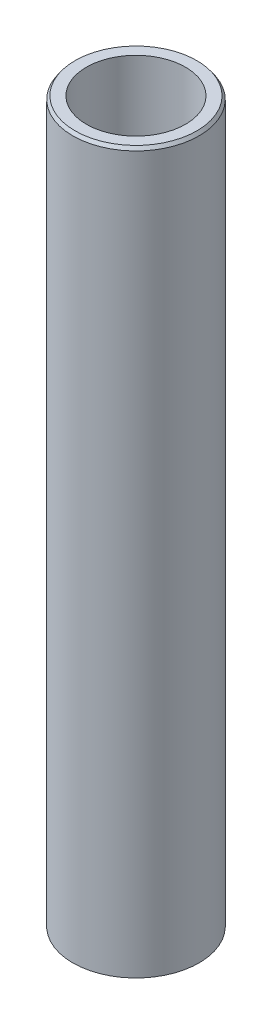
ISO-10303-21;
HEADER;
FILE_DESCRIPTION(('STEP AP214'),'2;1');
FILE_NAME('part.step','',(''),(''),'','','');
FILE_SCHEMA(('AUTOMOTIVE_DESIGN { 1 0 10303 214 1 1 1 1 }'));
ENDSEC;
DATA;
#1=APPLICATION_CONTEXT('core data for automotive mechanical design processes');
#2=APPLICATION_PROTOCOL_DEFINITION('international standard','automotive_design',2000,#1);
#3=PRODUCT_CONTEXT('',#1,'mechanical');
#4=PRODUCT('Part','Part','',(#3));
#5=PRODUCT_RELATED_PRODUCT_CATEGORY('part','',(#4));
#6=PRODUCT_DEFINITION_FORMATION('','',#4);
#7=PRODUCT_DEFINITION_CONTEXT('part definition',#1,'design');
#8=PRODUCT_DEFINITION('design','',#6,#7);
#9=PRODUCT_DEFINITION_SHAPE('','',#8);
#10=(LENGTH_UNIT() NAMED_UNIT(*) SI_UNIT(.MILLI.,.METRE.));
#11=(NAMED_UNIT(*) PLANE_ANGLE_UNIT() SI_UNIT($,.RADIAN.));
#12=(NAMED_UNIT(*) SI_UNIT($,.STERADIAN.) SOLID_ANGLE_UNIT());
#13=UNCERTAINTY_MEASURE_WITH_UNIT(LENGTH_MEASURE(1.E-05),#10,'distance_accuracy_value','');
#14=(GEOMETRIC_REPRESENTATION_CONTEXT(3) GLOBAL_UNCERTAINTY_ASSIGNED_CONTEXT((#13)) GLOBAL_UNIT_ASSIGNED_CONTEXT((#10,
#11,#12)) REPRESENTATION_CONTEXT('',''));
#15=CARTESIAN_POINT('',(0.,0.,0.));
#16=DIRECTION('',(0.,0.,1.));
#17=DIRECTION('',(1.,0.,0.));
#18=AXIS2_PLACEMENT_3D('',#15,#16,#17);
#19=CARTESIAN_POINT('',(0.,600.,0.));
#20=DIRECTION('',(0.,-1.,0.));
#21=DIRECTION('',(0.,0.,-1.));
#22=AXIS2_PLACEMENT_3D('',#19,#20,#21);
#23=CYLINDRICAL_SURFACE('',#22,52.5);
#24=CARTESIAN_POINT('',(0.,597.334114293965,0.));
#25=DIRECTION('',(0.,1.,0.));
#26=DIRECTION('',(0.,0.,1.));
#27=AXIS2_PLACEMENT_3D('',#24,#25,#26);
#28=CIRCLE('',#27,52.5);
#29=CARTESIAN_POINT('',(0.,597.334114293965,52.5));
#30=VERTEX_POINT('',#29);
#31=EDGE_CURVE('E50',#30,#30,#28,.F.);
#32=ORIENTED_EDGE('',*,*,#31,.T.);
#33=EDGE_LOOP('',(#32));
#34=FACE_BOUND('',#33,.T.);
#35=CARTESIAN_POINT('',(0.,1.87415105938094,0.));
#36=DIRECTION('',(0.,1.,0.));
#37=DIRECTION('',(0.,0.,1.));
#38=AXIS2_PLACEMENT_3D('',#35,#36,#37);
#39=CIRCLE('',#38,52.5);
#40=CARTESIAN_POINT('',(0.,1.87415105938094,52.5));
#41=VERTEX_POINT('',#40);
#42=EDGE_CURVE('E51',#41,#41,#39,.T.);
#43=ORIENTED_EDGE('',*,*,#42,.T.);
#44=EDGE_LOOP('',(#43));
#45=FACE_BOUND('',#44,.T.);
#46=ADVANCED_FACE('F39',(#34,#45),#23,.T.);
#47=CARTESIAN_POINT('',(0.,600.,0.));
#48=DIRECTION('',(0.,1.,0.));
#49=DIRECTION('',(0.,0.,1.));
#50=AXIS2_PLACEMENT_3D('',#47,#48,#49);
#51=PLANE('',#50);
#52=CARTESIAN_POINT('',(0.,600.,0.));
#53=DIRECTION('',(0.,1.,0.));
#54=DIRECTION('',(0.,0.,1.));
#55=AXIS2_PLACEMENT_3D('',#52,#53,#54);
#56=CIRCLE('',#55,50.6258489406192);
#57=CARTESIAN_POINT('',(0.,600.,50.6258489406192));
#58=VERTEX_POINT('',#57);
#59=EDGE_CURVE('E54',#58,#58,#56,.T.);
#60=ORIENTED_EDGE('',*,*,#59,.T.);
#61=EDGE_LOOP('',(#60));
#62=FACE_BOUND('',#61,.T.);
#63=CARTESIAN_POINT('',(0.,600.,0.));
#64=DIRECTION('',(0.,1.,0.));
#65=DIRECTION('',(0.,0.,1.));
#66=AXIS2_PLACEMENT_3D('',#63,#64,#65);
#67=CIRCLE('',#66,41.1868827034485);
#68=CARTESIAN_POINT('',(0.,600.,41.1868827034485));
#69=VERTEX_POINT('',#68);
#70=EDGE_CURVE('E58',#69,#69,#67,.T.);
#71=ORIENTED_EDGE('',*,*,#70,.F.);
#72=EDGE_LOOP('',(#71));
#73=FACE_BOUND('',#72,.T.);
#74=ADVANCED_FACE('F69',(#62,#73),#51,.T.);
#75=CARTESIAN_POINT('',(0.,0.,0.));
#76=DIRECTION('',(0.,1.,0.));
#77=DIRECTION('',(0.,0.,1.));
#78=AXIS2_PLACEMENT_3D('',#75,#76,#77);
#79=PLANE('',#78);
#80=CARTESIAN_POINT('',(0.,0.,0.));
#81=DIRECTION('',(0.,1.,0.));
#82=DIRECTION('',(0.,0.,1.));
#83=AXIS2_PLACEMENT_3D('',#80,#81,#82);
#84=CIRCLE('',#83,49.8341142939652);
#85=CARTESIAN_POINT('',(0.,0.,49.8341142939652));
#86=VERTEX_POINT('',#85);
#87=EDGE_CURVE('E10',#86,#86,#84,.F.);
#88=ORIENTED_EDGE('',*,*,#87,.T.);
#89=EDGE_LOOP('',(#88));
#90=FACE_BOUND('',#89,.T.);
#91=CARTESIAN_POINT('',(0.,0.,0.));
#92=DIRECTION('',(0.,1.,0.));
#93=DIRECTION('',(0.,0.,1.));
#94=AXIS2_PLACEMENT_3D('',#91,#92,#93);
#95=CIRCLE('',#94,41.1868827034485);
#96=CARTESIAN_POINT('',(0.,0.,41.1868827034485));
#97=VERTEX_POINT('',#96);
#98=EDGE_CURVE('E63',#97,#97,#95,.T.);
#99=ORIENTED_EDGE('',*,*,#98,.T.);
#100=EDGE_LOOP('',(#99));
#101=FACE_BOUND('',#100,.T.);
#102=ADVANCED_FACE('F75',(#90,#101),#79,.F.);
#103=CARTESIAN_POINT('',(0.,600.,0.));
#104=DIRECTION('',(0.,-1.,0.));
#105=DIRECTION('',(0.,0.,-1.));
#106=AXIS2_PLACEMENT_3D('',#103,#104,#105);
#107=CYLINDRICAL_SURFACE('',#106,41.1868827034485);
#108=ORIENTED_EDGE('',*,*,#70,.T.);
#109=EDGE_LOOP('',(#108));
#110=FACE_BOUND('',#109,.T.);
#111=ORIENTED_EDGE('',*,*,#98,.F.);
#112=EDGE_LOOP('',(#111));
#113=FACE_BOUND('',#112,.T.);
#114=ADVANCED_FACE('F70',(#110,#113),#107,.F.);
#115=CARTESIAN_POINT('',(0.,600.,0.));
#116=DIRECTION('',(0.,-1.,0.));
#117=DIRECTION('',(0.,0.,-1.));
#118=AXIS2_PLACEMENT_3D('',#115,#116,#117);
#119=CONICAL_SURFACE('',#118,50.6258489406192,0.612744937568206);
#120=ORIENTED_EDGE('',*,*,#31,.F.);
#121=EDGE_LOOP('',(#120));
#122=FACE_BOUND('',#121,.T.);
#123=ORIENTED_EDGE('',*,*,#59,.F.);
#124=EDGE_LOOP('',(#123));
#125=FACE_BOUND('',#124,.T.);
#126=ADVANCED_FACE('F81',(#122,#125),#119,.T.);
#127=CARTESIAN_POINT('',(0.,1.87415105938094,0.));
#128=DIRECTION('',(0.,1.,0.));
#129=DIRECTION('',(0.,0.,1.));
#130=AXIS2_PLACEMENT_3D('',#127,#128,#129);
#131=CONICAL_SURFACE('',#130,52.5,0.958051389226685);
#132=CARTESIAN_POINT('',(0.,0.,49.8341142939652));
#133=CARTESIAN_POINT('',(0.,0.019522406868552,49.8618839367364));
#134=CARTESIAN_POINT('',(0.,0.0390448137371033,49.8896535795076));
#135=CARTESIAN_POINT('',(0.,0.0780896274742058,49.94519286505));
#136=CARTESIAN_POINT('',(0.,0.0976120343427571,49.9729625078212));
#137=CARTESIAN_POINT('',(0.,0.136656848079859,50.0285017933636));
#138=CARTESIAN_POINT('',(0.,0.15617925494841,50.0562714361348));
#139=CARTESIAN_POINT('',(0.,0.195224068685514,50.1118107216772));
#140=CARTESIAN_POINT('',(0.,0.214746475554066,50.1395803644484));
#141=CARTESIAN_POINT('',(0.,0.253791289291169,50.1951196499908));
#142=CARTESIAN_POINT('',(0.,0.273313696159719,50.222889292762));
#143=CARTESIAN_POINT('',(0.,0.312358509896822,50.2784285783044));
#144=CARTESIAN_POINT('',(0.,0.331880916765374,50.3061982210755));
#145=CARTESIAN_POINT('',(0.,0.370925730502477,50.3617375066179));
#146=CARTESIAN_POINT('',(0.,0.390448137371027,50.3895071493891));
#147=CARTESIAN_POINT('',(0.,0.42949295110813,50.4450464349315));
#148=CARTESIAN_POINT('',(0.,0.449015357976683,50.4728160777027));
#149=CARTESIAN_POINT('',(0.,0.488060171713786,50.5283553632451));
#150=CARTESIAN_POINT('',(0.,0.507582578582336,50.5561250060163));
#151=CARTESIAN_POINT('',(0.,0.546627392319439,50.6116642915587));
#152=CARTESIAN_POINT('',(0.,0.566149799187991,50.6394339343299));
#153=CARTESIAN_POINT('',(0.,0.605194612925094,50.6949732198723));
#154=CARTESIAN_POINT('',(0.,0.624717019793644,50.7227428626435));
#155=CARTESIAN_POINT('',(0.,0.663761833530747,50.7782821481859));
#156=CARTESIAN_POINT('',(0.,0.6832842403993,50.8060517909571));
#157=CARTESIAN_POINT('',(0.,0.722329054136403,50.8615910764995));
#158=CARTESIAN_POINT('',(0.,0.741851461004953,50.8893607192707));
#159=CARTESIAN_POINT('',(0.,0.780896274742056,50.9449000048131));
#160=CARTESIAN_POINT('',(0.,0.800418681610608,50.9726696475842));
#161=CARTESIAN_POINT('',(0.,0.839463495347711,51.0282089331266));
#162=CARTESIAN_POINT('',(0.,0.858985902216261,51.0559785758978));
#163=CARTESIAN_POINT('',(0.,0.898030715953364,51.1115178614402));
#164=CARTESIAN_POINT('',(0.,0.917553122821916,51.1392875042114));
#165=CARTESIAN_POINT('',(0.,0.95659793655902,51.1948267897538));
#166=CARTESIAN_POINT('',(0.,0.976120343427571,51.222596432525));
#167=CARTESIAN_POINT('',(0.,1.01516515716467,51.2781357180674));
#168=CARTESIAN_POINT('',(0.,1.03468756403322,51.3059053608386));
#169=CARTESIAN_POINT('',(0.,1.07373237777033,51.361444646381));
#170=CARTESIAN_POINT('',(0.,1.09325478463888,51.3892142891522));
#171=CARTESIAN_POINT('',(0.,1.13229959837598,51.4447535746946));
#172=CARTESIAN_POINT('',(0.,1.15182200524453,51.4725232174658));
#173=CARTESIAN_POINT('',(0.,1.19086681898164,51.5280625030082));
#174=CARTESIAN_POINT('',(0.,1.21038922585019,51.5558321457793));
#175=CARTESIAN_POINT('',(0.,1.24943403958729,51.6113714313217));
#176=CARTESIAN_POINT('',(0.,1.26895644645584,51.6391410740929));
#177=CARTESIAN_POINT('',(0.,1.30800126019294,51.6946803596353));
#178=CARTESIAN_POINT('',(0.,1.3275236670615,51.7224500024065));
#179=CARTESIAN_POINT('',(0.,1.3665684807986,51.7779892879489));
#180=CARTESIAN_POINT('',(0.,1.38609088766715,51.8057589307201));
#181=CARTESIAN_POINT('',(0.,1.42513570140425,51.8612982162625));
#182=CARTESIAN_POINT('',(0.,1.4446581082728,51.8890678590337));
#183=CARTESIAN_POINT('',(0.,1.48370292200991,51.9446071445761));
#184=CARTESIAN_POINT('',(0.,1.50322532887846,51.9723767873473));
#185=CARTESIAN_POINT('',(0.,1.54227014261556,52.0279160728897));
#186=CARTESIAN_POINT('',(0.,1.56179254948411,52.0556857156609));
#187=CARTESIAN_POINT('',(0.,1.60083736322122,52.1112250012033));
#188=CARTESIAN_POINT('',(0.,1.62035977008977,52.1389946439745));
#189=CARTESIAN_POINT('',(0.,1.65940458382687,52.1945339295168));
#190=CARTESIAN_POINT('',(0.,1.67892699069542,52.222303572288));
#191=CARTESIAN_POINT('',(0.,1.71797180443252,52.2778428578304));
#192=CARTESIAN_POINT('',(0.,1.73749421130107,52.3056125006016));
#193=CARTESIAN_POINT('',(0.,1.77653902503818,52.361151786144));
#194=CARTESIAN_POINT('',(0.,1.79606143190673,52.3889214289152));
#195=CARTESIAN_POINT('',(0.,1.83510624564383,52.4444607144576));
#196=CARTESIAN_POINT('',(0.,1.85462865251239,52.4722303572288));
#197=CARTESIAN_POINT('',(0.,1.87415105938094,52.5));
#198=B_SPLINE_CURVE_WITH_KNOTS('',3,(#132,#133,#134,#135,#136,#137,#138,#139,#140,#141,#142,
#143,#144,#145,#146,#147,#148,#149,#150,#151,#152,#153,#154,#155,#156,#157,#158,#159,#160,#161,
#162,#163,#164,#165,#166,#167,#168,#169,#170,#171,#172,#173,#174,#175,#176,#177,#178,#179,#180,
#181,#182,#183,#184,#185,#186,#187,#188,#189,#190,#191,#192,#193,#194,#195,#196,#197),
.UNSPECIFIED.,.F.,.F.,(4,2,2,2,2,2,2,2,2,2,2,2,2,2,2,2,2,2,2,2,2,2,2,2,2,2,2,2,2,2,2,2,4),(0.,
0.101835636523906,0.203671273047817,0.305506909571729,0.407342546095635,0.509178182619546,
0.611013819143452,0.712849455667364,0.81468509219127,0.916520728715181,1.01835636523909,
1.120192001763,1.2220276382869,1.32386327481082,1.42569891133472,1.52753454785863,
1.62937018438254,1.73120582090645,1.83304145743036,1.93487709395427,2.03671273047818,
2.13854836700209,2.240384003526,2.3422196400499,2.44405527657381,2.54589091309772,
2.64772654962163,2.74956218614554,2.85139782266945,2.95323345919336,3.05506909571727,
3.15690473224117,3.25874036876508),.UNSPECIFIED.);
#199=EDGE_CURVE('BSEAM45',#86,#41,#198,.T.);
#200=ORIENTED_EDGE('',*,*,#87,.F.);
#201=ORIENTED_EDGE('',*,*,#42,.F.);
#202=ORIENTED_EDGE('',*,*,#199,.T.);
#203=ORIENTED_EDGE('',*,*,#199,.F.);
#204=EDGE_LOOP('',(#200,#202,#201,#203));
#205=FACE_BOUND('',#204,.T.);
#206=ADVANCED_FACE('F45',(#205),#131,.T.);
#207=CLOSED_SHELL('',(#46,#74,#102,#114,#126,#206));
#208=MANIFOLD_SOLID_BREP('B2',#207);
#209=ADVANCED_BREP_SHAPE_REPRESENTATION('',(#18,#208),#14);
#210=SHAPE_DEFINITION_REPRESENTATION(#9,#209);
ENDSEC;
END-ISO-10303-21;
